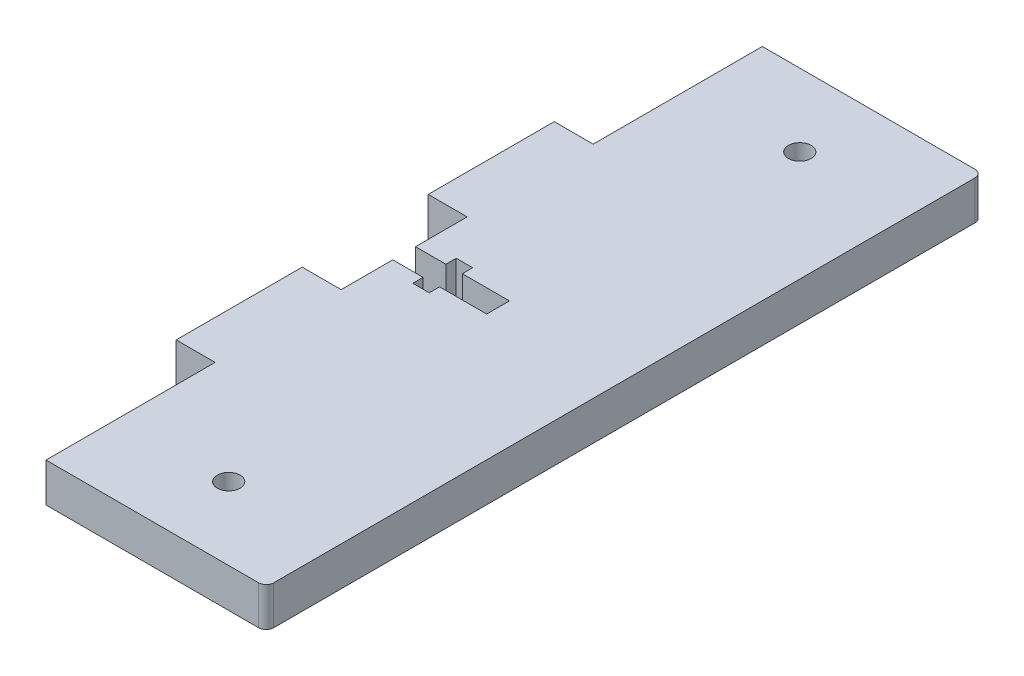
ISO-10303-21;
HEADER;
FILE_DESCRIPTION(('STEP AP214'),'2;1');
FILE_NAME('part.step','',(''),(''),'','','');
FILE_SCHEMA(('AUTOMOTIVE_DESIGN { 1 0 10303 214 1 1 1 1 }'));
ENDSEC;
DATA;
#1=APPLICATION_CONTEXT('core data for automotive mechanical design processes');
#2=APPLICATION_PROTOCOL_DEFINITION('international standard','automotive_design',2000,#1);
#3=PRODUCT_CONTEXT('',#1,'mechanical');
#4=PRODUCT('Part','Part','',(#3));
#5=PRODUCT_RELATED_PRODUCT_CATEGORY('part','',(#4));
#6=PRODUCT_DEFINITION_FORMATION('','',#4);
#7=PRODUCT_DEFINITION_CONTEXT('part definition',#1,'design');
#8=PRODUCT_DEFINITION('design','',#6,#7);
#9=PRODUCT_DEFINITION_SHAPE('','',#8);
#10=(LENGTH_UNIT() NAMED_UNIT(*) SI_UNIT(.MILLI.,.METRE.));
#11=(NAMED_UNIT(*) PLANE_ANGLE_UNIT() SI_UNIT($,.RADIAN.));
#12=(NAMED_UNIT(*) SI_UNIT($,.STERADIAN.) SOLID_ANGLE_UNIT());
#13=UNCERTAINTY_MEASURE_WITH_UNIT(LENGTH_MEASURE(1.E-05),#10,'distance_accuracy_value','');
#14=(GEOMETRIC_REPRESENTATION_CONTEXT(3) GLOBAL_UNCERTAINTY_ASSIGNED_CONTEXT((#13)) GLOBAL_UNIT_ASSIGNED_CONTEXT((#10,
#11,#12)) REPRESENTATION_CONTEXT('',''));
#15=CARTESIAN_POINT('',(0.,0.,0.));
#16=DIRECTION('',(0.,0.,1.));
#17=DIRECTION('',(1.,0.,0.));
#18=AXIS2_PLACEMENT_3D('',#15,#16,#17);
#19=CARTESIAN_POINT('',(12.0090859130973,5.13,-45.0431351735956));
#20=DIRECTION('',(0.,-1.,0.));
#21=DIRECTION('',(0.,0.,-1.));
#22=AXIS2_PLACEMENT_3D('',#19,#20,#21);
#23=CYLINDRICAL_SURFACE('',#22,1.);
#24=CARTESIAN_POINT('',(12.0090859130973,0.,-45.0431351735956));
#25=DIRECTION('',(0.,1.,0.));
#26=DIRECTION('',(0.,0.,1.));
#27=AXIS2_PLACEMENT_3D('',#24,#25,#26);
#28=CIRCLE('',#27,1.);
#29=CARTESIAN_POINT('',(12.0090859130973,0.,-46.0431351735956));
#30=VERTEX_POINT('',#29);
#31=CARTESIAN_POINT('',(13.0090859130973,0.,-45.0431351735956));
#32=VERTEX_POINT('',#31);
#33=EDGE_CURVE('E241',#30,#32,#28,.F.);
#34=ORIENTED_EDGE('',*,*,#33,.F.);
#35=DIRECTION('',(0.,-1.,0.));
#36=VECTOR('',#35,1.);
#37=CARTESIAN_POINT('',(12.0090859130973,5.13,-46.0431351735956));
#38=LINE('',#37,#36);
#39=CARTESIAN_POINT('',(12.0090859130973,5.13,-46.0431351735956));
#40=VERTEX_POINT('',#39);
#41=EDGE_CURVE('E11',#40,#30,#38,.T.);
#42=ORIENTED_EDGE('',*,*,#41,.F.);
#43=CARTESIAN_POINT('',(12.0090859130973,5.13,-45.0431351735956));
#44=DIRECTION('',(0.,1.,0.));
#45=DIRECTION('',(0.,0.,1.));
#46=AXIS2_PLACEMENT_3D('',#43,#44,#45);
#47=CIRCLE('',#46,1.);
#48=CARTESIAN_POINT('',(13.0090859130973,5.13,-45.0431351735956));
#49=VERTEX_POINT('',#48);
#50=EDGE_CURVE('E316',#40,#49,#47,.F.);
#51=ORIENTED_EDGE('',*,*,#50,.T.);
#52=DIRECTION('',(0.,-1.,0.));
#53=VECTOR('',#52,1.);
#54=CARTESIAN_POINT('',(13.0090859130973,5.13,-45.0431351735956));
#55=LINE('',#54,#53);
#56=EDGE_CURVE('E137',#49,#32,#55,.T.);
#57=ORIENTED_EDGE('',*,*,#56,.T.);
#58=EDGE_LOOP('',(#34,#42,#51,#57));
#59=FACE_BOUND('',#58,.T.);
#60=ADVANCED_FACE('F33',(#59),#23,.T.);
#61=CARTESIAN_POINT('',(-82.2456745189973,5.13,-46.0431351735956));
#62=DIRECTION('',(0.,0.,-1.));
#63=DIRECTION('',(-1.,0.,0.));
#64=AXIS2_PLACEMENT_3D('',#61,#62,#63);
#65=PLANE('',#64);
#66=DIRECTION('',(1.,0.,0.));
#67=VECTOR('',#66,1.);
#68=CARTESIAN_POINT('',(-82.2456745189973,0.,-46.0431351735956));
#69=LINE('',#68,#67);
#70=CARTESIAN_POINT('',(-15.9909140869027,0.,-46.0431351735956));
#71=VERTEX_POINT('',#70);
#72=EDGE_CURVE('E244',#71,#30,#69,.T.);
#73=ORIENTED_EDGE('',*,*,#72,.F.);
#74=DIRECTION('',(0.,-1.,0.));
#75=VECTOR('',#74,1.);
#76=CARTESIAN_POINT('',(-15.9909140869027,5.13,-46.0431351735956));
#77=LINE('',#76,#75);
#78=CARTESIAN_POINT('',(-15.9909140869027,5.13,-46.0431351735956));
#79=VERTEX_POINT('',#78);
#80=EDGE_CURVE('E41',#79,#71,#77,.T.);
#81=ORIENTED_EDGE('',*,*,#80,.F.);
#82=DIRECTION('',(1.,0.,0.));
#83=VECTOR('',#82,1.);
#84=CARTESIAN_POINT('',(-82.2456745189973,5.13,-46.0431351735956));
#85=LINE('',#84,#83);
#86=EDGE_CURVE('E386',#79,#40,#85,.T.);
#87=ORIENTED_EDGE('',*,*,#86,.T.);
#88=ORIENTED_EDGE('',*,*,#41,.T.);
#89=EDGE_LOOP('',(#73,#81,#87,#88));
#90=FACE_BOUND('',#89,.T.);
#91=ADVANCED_FACE('F373',(#90),#65,.T.);
#92=CARTESIAN_POINT('',(-15.9909140869027,5.13,1.13686482640438));
#93=DIRECTION('',(-1.,0.,0.));
#94=DIRECTION('',(0.,0.,1.));
#95=AXIS2_PLACEMENT_3D('',#92,#93,#94);
#96=PLANE('',#95);
#97=DIRECTION('',(0.,0.,-1.));
#98=VECTOR('',#97,1.);
#99=CARTESIAN_POINT('',(-15.9909140869027,0.,1.13686482640438));
#100=LINE('',#99,#98);
#101=CARTESIAN_POINT('',(-15.9909140869027,0.,-23.7631351735957));
#102=VERTEX_POINT('',#101);
#103=EDGE_CURVE('E247',#102,#71,#100,.T.);
#104=ORIENTED_EDGE('',*,*,#103,.F.);
#105=DIRECTION('',(0.,-1.,0.));
#106=VECTOR('',#105,1.);
#107=CARTESIAN_POINT('',(-15.9909140869027,5.13,-23.7631351735957));
#108=LINE('',#107,#106);
#109=CARTESIAN_POINT('',(-15.9909140869027,5.13,-23.7631351735957));
#110=VERTEX_POINT('',#109);
#111=EDGE_CURVE('E362',#110,#102,#108,.T.);
#112=ORIENTED_EDGE('',*,*,#111,.F.);
#113=DIRECTION('',(0.,0.,-1.));
#114=VECTOR('',#113,1.);
#115=CARTESIAN_POINT('',(-15.9909140869027,5.13,1.13686482640438));
#116=LINE('',#115,#114);
#117=EDGE_CURVE('E369',#110,#79,#116,.T.);
#118=ORIENTED_EDGE('',*,*,#117,.T.);
#119=ORIENTED_EDGE('',*,*,#80,.T.);
#120=EDGE_LOOP('',(#104,#112,#118,#119));
#121=FACE_BOUND('',#120,.T.);
#122=ADVANCED_FACE('F367',(#121),#96,.T.);
#123=CARTESIAN_POINT('',(-82.2456745189973,5.13,-23.7631351735957));
#124=DIRECTION('',(0.,0.,-1.));
#125=DIRECTION('',(-1.,0.,0.));
#126=AXIS2_PLACEMENT_3D('',#123,#124,#125);
#127=PLANE('',#126);
#128=DIRECTION('',(1.,0.,0.));
#129=VECTOR('',#128,1.);
#130=CARTESIAN_POINT('',(-82.2456745189973,0.,-23.7631351735957));
#131=LINE('',#130,#129);
#132=CARTESIAN_POINT('',(-21.1209140869026,0.,-23.7631351735957));
#133=VERTEX_POINT('',#132);
#134=EDGE_CURVE('E250',#133,#102,#131,.T.);
#135=ORIENTED_EDGE('',*,*,#134,.F.);
#136=DIRECTION('',(0.,-1.,0.));
#137=VECTOR('',#136,1.);
#138=CARTESIAN_POINT('',(-21.1209140869026,5.13,-23.7631351735957));
#139=LINE('',#138,#137);
#140=CARTESIAN_POINT('',(-21.1209140869026,5.13,-23.7631351735957));
#141=VERTEX_POINT('',#140);
#142=EDGE_CURVE('E360',#141,#133,#139,.T.);
#143=ORIENTED_EDGE('',*,*,#142,.F.);
#144=DIRECTION('',(1.,0.,0.));
#145=VECTOR('',#144,1.);
#146=CARTESIAN_POINT('',(-82.2456745189973,5.13,-23.7631351735957));
#147=LINE('',#146,#145);
#148=EDGE_CURVE('E383',#141,#110,#147,.T.);
#149=ORIENTED_EDGE('',*,*,#148,.T.);
#150=ORIENTED_EDGE('',*,*,#111,.T.);
#151=EDGE_LOOP('',(#135,#143,#149,#150));
#152=FACE_BOUND('',#151,.T.);
#153=ADVANCED_FACE('F380',(#152),#127,.T.);
#154=CARTESIAN_POINT('',(-21.1209140869026,5.13,1.13686482640437));
#155=DIRECTION('',(-1.,0.,0.));
#156=DIRECTION('',(0.,0.,1.));
#157=AXIS2_PLACEMENT_3D('',#154,#155,#156);
#158=PLANE('',#157);
#159=DIRECTION('',(0.,0.,-1.));
#160=VECTOR('',#159,1.);
#161=CARTESIAN_POINT('',(-21.1209140869026,0.,1.13686482640437));
#162=LINE('',#161,#160);
#163=CARTESIAN_POINT('',(-21.1209140869026,0.,-7.16313517359567));
#164=VERTEX_POINT('',#163);
#165=EDGE_CURVE('E253',#164,#133,#162,.T.);
#166=ORIENTED_EDGE('',*,*,#165,.F.);
#167=DIRECTION('',(0.,-1.,0.));
#168=VECTOR('',#167,1.);
#169=CARTESIAN_POINT('',(-21.1209140869026,5.13,-7.16313517359567));
#170=LINE('',#169,#168);
#171=CARTESIAN_POINT('',(-21.1209140869026,5.13,-7.16313517359567));
#172=VERTEX_POINT('',#171);
#173=EDGE_CURVE('E358',#172,#164,#170,.T.);
#174=ORIENTED_EDGE('',*,*,#173,.F.);
#175=DIRECTION('',(0.,0.,-1.));
#176=VECTOR('',#175,1.);
#177=CARTESIAN_POINT('',(-21.1209140869026,5.13,1.13686482640437));
#178=LINE('',#177,#176);
#179=EDGE_CURVE('E388',#172,#141,#178,.T.);
#180=ORIENTED_EDGE('',*,*,#179,.T.);
#181=ORIENTED_EDGE('',*,*,#142,.T.);
#182=EDGE_LOOP('',(#166,#174,#180,#181));
#183=FACE_BOUND('',#182,.T.);
#184=ADVANCED_FACE('F462',(#183),#158,.T.);
#185=CARTESIAN_POINT('',(-82.2456745189973,5.13,-7.16313517359566));
#186=DIRECTION('',(0.,0.,1.));
#187=DIRECTION('',(1.,0.,0.));
#188=AXIS2_PLACEMENT_3D('',#185,#186,#187);
#189=PLANE('',#188);
#190=DIRECTION('',(-1.,0.,0.));
#191=VECTOR('',#190,1.);
#192=CARTESIAN_POINT('',(-82.2456745189973,0.,-7.16313517359566));
#193=LINE('',#192,#191);
#194=CARTESIAN_POINT('',(-15.9909140869026,0.,-7.16313517359567));
#195=VERTEX_POINT('',#194);
#196=EDGE_CURVE('E256',#195,#164,#193,.T.);
#197=ORIENTED_EDGE('',*,*,#196,.F.);
#198=DIRECTION('',(0.,-1.,0.));
#199=VECTOR('',#198,1.);
#200=CARTESIAN_POINT('',(-15.9909140869026,5.13,-7.16313517359567));
#201=LINE('',#200,#199);
#202=CARTESIAN_POINT('',(-15.9909140869026,5.13,-7.16313517359567));
#203=VERTEX_POINT('',#202);
#204=EDGE_CURVE('E356',#203,#195,#201,.T.);
#205=ORIENTED_EDGE('',*,*,#204,.F.);
#206=DIRECTION('',(-1.,0.,0.));
#207=VECTOR('',#206,1.);
#208=CARTESIAN_POINT('',(-82.2456745189973,5.13,-7.16313517359566));
#209=LINE('',#208,#207);
#210=EDGE_CURVE('E394',#203,#172,#209,.T.);
#211=ORIENTED_EDGE('',*,*,#210,.T.);
#212=ORIENTED_EDGE('',*,*,#173,.T.);
#213=EDGE_LOOP('',(#197,#205,#211,#212));
#214=FACE_BOUND('',#213,.T.);
#215=ADVANCED_FACE('F465',(#214),#189,.T.);
#216=CARTESIAN_POINT('',(-15.9909140869026,5.13,1.13686482640438));
#217=DIRECTION('',(-1.,0.,0.));
#218=DIRECTION('',(0.,0.,1.));
#219=AXIS2_PLACEMENT_3D('',#216,#217,#218);
#220=PLANE('',#219);
#221=DIRECTION('',(0.,0.,-1.));
#222=VECTOR('',#221,1.);
#223=CARTESIAN_POINT('',(-15.9909140869026,0.,1.13686482640438));
#224=LINE('',#223,#222);
#225=CARTESIAN_POINT('',(-15.9909140869026,0.,-0.361635173595668));
#226=VERTEX_POINT('',#225);
#227=EDGE_CURVE('E259',#226,#195,#224,.T.);
#228=ORIENTED_EDGE('',*,*,#227,.F.);
#229=DIRECTION('',(0.,-1.,0.));
#230=VECTOR('',#229,1.);
#231=CARTESIAN_POINT('',(-15.9909140869026,5.13,-0.361635173595668));
#232=LINE('',#231,#230);
#233=CARTESIAN_POINT('',(-15.9909140869026,5.13,-0.361635173595668));
#234=VERTEX_POINT('',#233);
#235=EDGE_CURVE('E354',#234,#226,#232,.T.);
#236=ORIENTED_EDGE('',*,*,#235,.F.);
#237=DIRECTION('',(0.,0.,-1.));
#238=VECTOR('',#237,1.);
#239=CARTESIAN_POINT('',(-15.9909140869026,5.13,1.13686482640438));
#240=LINE('',#239,#238);
#241=EDGE_CURVE('E397',#234,#203,#240,.T.);
#242=ORIENTED_EDGE('',*,*,#241,.T.);
#243=ORIENTED_EDGE('',*,*,#204,.T.);
#244=EDGE_LOOP('',(#228,#236,#242,#243));
#245=FACE_BOUND('',#244,.T.);
#246=ADVANCED_FACE('F469',(#245),#220,.T.);
#247=CARTESIAN_POINT('',(-82.2456745189973,5.13,-0.361635173595757));
#248=DIRECTION('',(0.,0.,1.));
#249=DIRECTION('',(1.,0.,0.));
#250=AXIS2_PLACEMENT_3D('',#247,#248,#249);
#251=PLANE('',#250);
#252=DIRECTION('',(-1.,0.,0.));
#253=VECTOR('',#252,1.);
#254=CARTESIAN_POINT('',(-82.2456745189973,0.,-0.361635173595757));
#255=LINE('',#254,#253);
#256=CARTESIAN_POINT('',(-11.9959140869028,0.,-0.361635173595662));
#257=VERTEX_POINT('',#256);
#258=EDGE_CURVE('E262',#257,#226,#255,.T.);
#259=ORIENTED_EDGE('',*,*,#258,.F.);
#260=DIRECTION('',(0.,-1.,0.));
#261=VECTOR('',#260,1.);
#262=CARTESIAN_POINT('',(-11.9959140869028,5.13,-0.361635173595662));
#263=LINE('',#262,#261);
#264=CARTESIAN_POINT('',(-11.9959140869028,5.13,-0.361635173595662));
#265=VERTEX_POINT('',#264);
#266=EDGE_CURVE('E352',#265,#257,#263,.T.);
#267=ORIENTED_EDGE('',*,*,#266,.F.);
#268=DIRECTION('',(-1.,0.,0.));
#269=VECTOR('',#268,1.);
#270=CARTESIAN_POINT('',(-82.2456745189973,5.13,-0.361635173595757));
#271=LINE('',#270,#269);
#272=EDGE_CURVE('E400',#265,#234,#271,.T.);
#273=ORIENTED_EDGE('',*,*,#272,.T.);
#274=ORIENTED_EDGE('',*,*,#235,.T.);
#275=EDGE_LOOP('',(#259,#267,#273,#274));
#276=FACE_BOUND('',#275,.T.);
#277=ADVANCED_FACE('F473',(#276),#251,.T.);
#278=CARTESIAN_POINT('',(-11.9959140869028,5.13,1.13686482640456));
#279=DIRECTION('',(1.,0.,0.));
#280=DIRECTION('',(0.,0.,-1.));
#281=AXIS2_PLACEMENT_3D('',#278,#279,#280);
#282=PLANE('',#281);
#283=DIRECTION('',(0.,0.,1.));
#284=VECTOR('',#283,1.);
#285=CARTESIAN_POINT('',(-11.9959140869028,0.,1.13686482640456));
#286=LINE('',#285,#284);
#287=CARTESIAN_POINT('',(-11.9959140869028,0.,-1.72063517359567));
#288=VERTEX_POINT('',#287);
#289=EDGE_CURVE('E265',#288,#257,#286,.T.);
#290=ORIENTED_EDGE('',*,*,#289,.F.);
#291=DIRECTION('',(0.,-1.,0.));
#292=VECTOR('',#291,1.);
#293=CARTESIAN_POINT('',(-11.9959140869028,5.13,-1.72063517359567));
#294=LINE('',#293,#292);
#295=CARTESIAN_POINT('',(-11.9959140869028,5.13,-1.72063517359567));
#296=VERTEX_POINT('',#295);
#297=EDGE_CURVE('E350',#296,#288,#294,.T.);
#298=ORIENTED_EDGE('',*,*,#297,.F.);
#299=DIRECTION('',(0.,0.,1.));
#300=VECTOR('',#299,1.);
#301=CARTESIAN_POINT('',(-11.9959140869028,5.13,1.13686482640456));
#302=LINE('',#301,#300);
#303=EDGE_CURVE('E403',#296,#265,#302,.T.);
#304=ORIENTED_EDGE('',*,*,#303,.T.);
#305=ORIENTED_EDGE('',*,*,#266,.T.);
#306=EDGE_LOOP('',(#290,#298,#304,#305));
#307=FACE_BOUND('',#306,.T.);
#308=ADVANCED_FACE('F477',(#307),#282,.T.);
#309=CARTESIAN_POINT('',(-82.2456745189972,5.13,-1.72063517360027));
#310=DIRECTION('',(0.,0.,1.));
#311=DIRECTION('',(1.,0.,0.));
#312=AXIS2_PLACEMENT_3D('',#309,#310,#311);
#313=PLANE('',#312);
#314=DIRECTION('',(-1.,0.,0.));
#315=VECTOR('',#314,1.);
#316=CARTESIAN_POINT('',(-82.2456745189972,0.,-1.72063517360027));
#317=LINE('',#316,#315);
#318=CARTESIAN_POINT('',(-9.82891408690274,0.,-1.72063517359553));
#319=VERTEX_POINT('',#318);
#320=EDGE_CURVE('E268',#319,#288,#317,.T.);
#321=ORIENTED_EDGE('',*,*,#320,.F.);
#322=DIRECTION('',(0.,-1.,0.));
#323=VECTOR('',#322,1.);
#324=CARTESIAN_POINT('',(-9.82891408690274,5.13,-1.72063517359553));
#325=LINE('',#324,#323);
#326=CARTESIAN_POINT('',(-9.82891408690274,5.13,-1.72063517359553));
#327=VERTEX_POINT('',#326);
#328=EDGE_CURVE('E348',#327,#319,#325,.T.);
#329=ORIENTED_EDGE('',*,*,#328,.F.);
#330=DIRECTION('',(-1.,0.,0.));
#331=VECTOR('',#330,1.);
#332=CARTESIAN_POINT('',(-82.2456745189972,5.13,-1.72063517360027));
#333=LINE('',#332,#331);
#334=EDGE_CURVE('E406',#327,#296,#333,.T.);
#335=ORIENTED_EDGE('',*,*,#334,.T.);
#336=ORIENTED_EDGE('',*,*,#297,.T.);
#337=EDGE_LOOP('',(#321,#329,#335,#336));
#338=FACE_BOUND('',#337,.T.);
#339=ADVANCED_FACE('F481',(#338),#313,.T.);
#340=CARTESIAN_POINT('',(-9.82891408690274,5.13,1.13686482640456));
#341=DIRECTION('',(-1.,0.,0.));
#342=DIRECTION('',(0.,0.,1.));
#343=AXIS2_PLACEMENT_3D('',#340,#341,#342);
#344=PLANE('',#343);
#345=DIRECTION('',(0.,0.,-1.));
#346=VECTOR('',#345,1.);
#347=CARTESIAN_POINT('',(-9.82891408690274,0.,1.13686482640456));
#348=LINE('',#347,#346);
#349=CARTESIAN_POINT('',(-9.82891408690274,0.,-0.361635173595597));
#350=VERTEX_POINT('',#349);
#351=EDGE_CURVE('E271',#350,#319,#348,.T.);
#352=ORIENTED_EDGE('',*,*,#351,.F.);
#353=DIRECTION('',(0.,-1.,0.));
#354=VECTOR('',#353,1.);
#355=CARTESIAN_POINT('',(-9.82891408690274,5.13,-0.361635173595597));
#356=LINE('',#355,#354);
#357=CARTESIAN_POINT('',(-9.82891408690274,5.13,-0.361635173595597));
#358=VERTEX_POINT('',#357);
#359=EDGE_CURVE('E346',#358,#350,#356,.T.);
#360=ORIENTED_EDGE('',*,*,#359,.F.);
#361=DIRECTION('',(0.,0.,-1.));
#362=VECTOR('',#361,1.);
#363=CARTESIAN_POINT('',(-9.82891408690274,5.13,1.13686482640456));
#364=LINE('',#363,#362);
#365=EDGE_CURVE('E409',#358,#327,#364,.T.);
#366=ORIENTED_EDGE('',*,*,#365,.T.);
#367=ORIENTED_EDGE('',*,*,#328,.T.);
#368=EDGE_LOOP('',(#352,#360,#366,#367));
#369=FACE_BOUND('',#368,.T.);
#370=ADVANCED_FACE('F485',(#369),#344,.T.);
#371=CARTESIAN_POINT('',(-82.2456745189973,5.13,-0.3616351735994));
#372=DIRECTION('',(0.,0.,1.));
#373=DIRECTION('',(1.,0.,0.));
#374=AXIS2_PLACEMENT_3D('',#371,#372,#373);
#375=PLANE('',#374);
#376=DIRECTION('',(-1.,0.,0.));
#377=VECTOR('',#376,1.);
#378=CARTESIAN_POINT('',(-82.2456745189973,0.,-0.3616351735994));
#379=LINE('',#378,#377);
#380=CARTESIAN_POINT('',(-3.62191408690178,0.,-0.361635173595271));
#381=VERTEX_POINT('',#380);
#382=EDGE_CURVE('E274',#381,#350,#379,.T.);
#383=ORIENTED_EDGE('',*,*,#382,.F.);
#384=DIRECTION('',(0.,-1.,0.));
#385=VECTOR('',#384,1.);
#386=CARTESIAN_POINT('',(-3.62191408690178,5.13,-0.361635173595271));
#387=LINE('',#386,#385);
#388=CARTESIAN_POINT('',(-3.62191408690178,5.13,-0.361635173595271));
#389=VERTEX_POINT('',#388);
#390=EDGE_CURVE('E344',#389,#381,#387,.T.);
#391=ORIENTED_EDGE('',*,*,#390,.F.);
#392=DIRECTION('',(-1.,0.,0.));
#393=VECTOR('',#392,1.);
#394=CARTESIAN_POINT('',(-82.2456745189973,5.13,-0.3616351735994));
#395=LINE('',#394,#393);
#396=EDGE_CURVE('E412',#389,#358,#395,.T.);
#397=ORIENTED_EDGE('',*,*,#396,.T.);
#398=ORIENTED_EDGE('',*,*,#359,.T.);
#399=EDGE_LOOP('',(#383,#391,#397,#398));
#400=FACE_BOUND('',#399,.T.);
#401=ADVANCED_FACE('F489',(#400),#375,.T.);
#402=CARTESIAN_POINT('',(-3.62191408690181,5.13,1.13686482640593));
#403=DIRECTION('',(-1.,0.,0.));
#404=DIRECTION('',(0.,0.,1.));
#405=AXIS2_PLACEMENT_3D('',#402,#403,#404);
#406=PLANE('',#405);
#407=DIRECTION('',(0.,0.,-1.));
#408=VECTOR('',#407,1.);
#409=CARTESIAN_POINT('',(-3.62191408690181,0.,1.13686482640593));
#410=LINE('',#409,#408);
#411=CARTESIAN_POINT('',(-3.62191408690184,0.,2.63536482640482));
#412=VERTEX_POINT('',#411);
#413=EDGE_CURVE('E277',#412,#381,#410,.T.);
#414=ORIENTED_EDGE('',*,*,#413,.F.);
#415=DIRECTION('',(0.,-1.,0.));
#416=VECTOR('',#415,1.);
#417=CARTESIAN_POINT('',(-3.62191408690184,5.13,2.63536482640482));
#418=LINE('',#417,#416);
#419=CARTESIAN_POINT('',(-3.62191408690184,5.13,2.63536482640482));
#420=VERTEX_POINT('',#419);
#421=EDGE_CURVE('E342',#420,#412,#418,.T.);
#422=ORIENTED_EDGE('',*,*,#421,.F.);
#423=DIRECTION('',(0.,0.,-1.));
#424=VECTOR('',#423,1.);
#425=CARTESIAN_POINT('',(-3.62191408690181,5.13,1.13686482640593));
#426=LINE('',#425,#424);
#427=EDGE_CURVE('E415',#420,#389,#426,.T.);
#428=ORIENTED_EDGE('',*,*,#427,.T.);
#429=ORIENTED_EDGE('',*,*,#390,.T.);
#430=EDGE_LOOP('',(#414,#422,#428,#429));
#431=FACE_BOUND('',#430,.T.);
#432=ADVANCED_FACE('F493',(#431),#406,.T.);
#433=CARTESIAN_POINT('',(-82.2456745189974,5.13,2.63536482640025));
#434=DIRECTION('',(0.,0.,-1.));
#435=DIRECTION('',(-1.,0.,0.));
#436=AXIS2_PLACEMENT_3D('',#433,#434,#435);
#437=PLANE('',#436);
#438=DIRECTION('',(1.,0.,0.));
#439=VECTOR('',#438,1.);
#440=CARTESIAN_POINT('',(-82.2456745189974,0.,2.63536482640025));
#441=LINE('',#440,#439);
#442=CARTESIAN_POINT('',(-9.82891408690178,0.,2.63536482640446));
#443=VERTEX_POINT('',#442);
#444=EDGE_CURVE('E280',#443,#412,#441,.T.);
#445=ORIENTED_EDGE('',*,*,#444,.F.);
#446=DIRECTION('',(0.,-1.,0.));
#447=VECTOR('',#446,1.);
#448=CARTESIAN_POINT('',(-9.82891408690178,5.13,2.63536482640446));
#449=LINE('',#448,#447);
#450=CARTESIAN_POINT('',(-9.82891408690178,5.13,2.63536482640446));
#451=VERTEX_POINT('',#450);
#452=EDGE_CURVE('E340',#451,#443,#449,.T.);
#453=ORIENTED_EDGE('',*,*,#452,.F.);
#454=DIRECTION('',(1.,0.,0.));
#455=VECTOR('',#454,1.);
#456=CARTESIAN_POINT('',(-82.2456745189974,5.13,2.63536482640025));
#457=LINE('',#456,#455);
#458=EDGE_CURVE('E418',#451,#420,#457,.T.);
#459=ORIENTED_EDGE('',*,*,#458,.T.);
#460=ORIENTED_EDGE('',*,*,#421,.T.);
#461=EDGE_LOOP('',(#445,#453,#459,#460));
#462=FACE_BOUND('',#461,.T.);
#463=ADVANCED_FACE('F497',(#462),#437,.T.);
#464=CARTESIAN_POINT('',(-9.82891408690177,5.13,1.13686482640456));
#465=DIRECTION('',(-1.,0.,0.));
#466=DIRECTION('',(0.,0.,1.));
#467=AXIS2_PLACEMENT_3D('',#464,#465,#466);
#468=PLANE('',#467);
#469=DIRECTION('',(0.,0.,-1.));
#470=VECTOR('',#469,1.);
#471=CARTESIAN_POINT('',(-9.82891408690177,0.,1.13686482640456));
#472=LINE('',#471,#470);
#473=CARTESIAN_POINT('',(-9.82891408690178,0.,3.99436482640448));
#474=VERTEX_POINT('',#473);
#475=EDGE_CURVE('E283',#474,#443,#472,.T.);
#476=ORIENTED_EDGE('',*,*,#475,.F.);
#477=DIRECTION('',(0.,-1.,0.));
#478=VECTOR('',#477,1.);
#479=CARTESIAN_POINT('',(-9.82891408690178,5.13,3.99436482640448));
#480=LINE('',#479,#478);
#481=CARTESIAN_POINT('',(-9.82891408690178,5.13,3.99436482640448));
#482=VERTEX_POINT('',#481);
#483=EDGE_CURVE('E338',#482,#474,#480,.T.);
#484=ORIENTED_EDGE('',*,*,#483,.F.);
#485=DIRECTION('',(0.,0.,-1.));
#486=VECTOR('',#485,1.);
#487=CARTESIAN_POINT('',(-9.82891408690177,5.13,1.13686482640456));
#488=LINE('',#487,#486);
#489=EDGE_CURVE('E421',#482,#451,#488,.T.);
#490=ORIENTED_EDGE('',*,*,#489,.T.);
#491=ORIENTED_EDGE('',*,*,#452,.T.);
#492=EDGE_LOOP('',(#476,#484,#490,#491));
#493=FACE_BOUND('',#492,.T.);
#494=ADVANCED_FACE('F501',(#493),#468,.T.);
#495=CARTESIAN_POINT('',(-82.2456745189975,5.13,3.9943648263997));
#496=DIRECTION('',(0.,0.,-1.));
#497=DIRECTION('',(-1.,0.,0.));
#498=AXIS2_PLACEMENT_3D('',#495,#496,#497);
#499=PLANE('',#498);
#500=DIRECTION('',(1.,0.,0.));
#501=VECTOR('',#500,1.);
#502=CARTESIAN_POINT('',(-82.2456745189975,0.,3.9943648263997));
#503=LINE('',#502,#501);
#504=CARTESIAN_POINT('',(-11.9959140869018,0.,3.99436482640434));
#505=VERTEX_POINT('',#504);
#506=EDGE_CURVE('E286',#505,#474,#503,.T.);
#507=ORIENTED_EDGE('',*,*,#506,.F.);
#508=DIRECTION('',(0.,-1.,0.));
#509=VECTOR('',#508,1.);
#510=CARTESIAN_POINT('',(-11.9959140869018,5.13,3.99436482640434));
#511=LINE('',#510,#509);
#512=CARTESIAN_POINT('',(-11.9959140869018,5.13,3.99436482640434));
#513=VERTEX_POINT('',#512);
#514=EDGE_CURVE('E336',#513,#505,#511,.T.);
#515=ORIENTED_EDGE('',*,*,#514,.F.);
#516=DIRECTION('',(1.,0.,0.));
#517=VECTOR('',#516,1.);
#518=CARTESIAN_POINT('',(-82.2456745189975,5.13,3.9943648263997));
#519=LINE('',#518,#517);
#520=EDGE_CURVE('E424',#513,#482,#519,.T.);
#521=ORIENTED_EDGE('',*,*,#520,.T.);
#522=ORIENTED_EDGE('',*,*,#483,.T.);
#523=EDGE_LOOP('',(#507,#515,#521,#522));
#524=FACE_BOUND('',#523,.T.);
#525=ADVANCED_FACE('F505',(#524),#499,.T.);
#526=CARTESIAN_POINT('',(-11.9959140869018,5.13,1.13686482640456));
#527=DIRECTION('',(1.,0.,0.));
#528=DIRECTION('',(0.,0.,-1.));
#529=AXIS2_PLACEMENT_3D('',#526,#527,#528);
#530=PLANE('',#529);
#531=DIRECTION('',(0.,0.,1.));
#532=VECTOR('',#531,1.);
#533=CARTESIAN_POINT('',(-11.9959140869018,0.,1.13686482640456));
#534=LINE('',#533,#532);
#535=CARTESIAN_POINT('',(-11.9959140869018,0.,2.63536482640438));
#536=VERTEX_POINT('',#535);
#537=EDGE_CURVE('E289',#536,#505,#534,.T.);
#538=ORIENTED_EDGE('',*,*,#537,.F.);
#539=DIRECTION('',(0.,-1.,0.));
#540=VECTOR('',#539,1.);
#541=CARTESIAN_POINT('',(-11.9959140869018,5.13,2.63536482640438));
#542=LINE('',#541,#540);
#543=CARTESIAN_POINT('',(-11.9959140869018,5.13,2.63536482640438));
#544=VERTEX_POINT('',#543);
#545=EDGE_CURVE('E334',#544,#536,#542,.T.);
#546=ORIENTED_EDGE('',*,*,#545,.F.);
#547=DIRECTION('',(0.,0.,1.));
#548=VECTOR('',#547,1.);
#549=CARTESIAN_POINT('',(-11.9959140869018,5.13,1.13686482640456));
#550=LINE('',#549,#548);
#551=EDGE_CURVE('E427',#544,#513,#550,.T.);
#552=ORIENTED_EDGE('',*,*,#551,.T.);
#553=ORIENTED_EDGE('',*,*,#514,.T.);
#554=EDGE_LOOP('',(#538,#546,#552,#553));
#555=FACE_BOUND('',#554,.T.);
#556=ADVANCED_FACE('F509',(#555),#530,.T.);
#557=CARTESIAN_POINT('',(-82.2456745189973,5.13,2.63536482640428));
#558=DIRECTION('',(0.,0.,-1.));
#559=DIRECTION('',(-1.,0.,0.));
#560=AXIS2_PLACEMENT_3D('',#557,#558,#559);
#561=PLANE('',#560);
#562=DIRECTION('',(1.,0.,0.));
#563=VECTOR('',#562,1.);
#564=CARTESIAN_POINT('',(-82.2456745189973,0.,2.63536482640428));
#565=LINE('',#564,#563);
#566=CARTESIAN_POINT('',(-15.9909140869027,0.,2.63536482640437));
#567=VERTEX_POINT('',#566);
#568=EDGE_CURVE('E292',#567,#536,#565,.T.);
#569=ORIENTED_EDGE('',*,*,#568,.F.);
#570=DIRECTION('',(0.,-1.,0.));
#571=VECTOR('',#570,1.);
#572=CARTESIAN_POINT('',(-15.9909140869027,5.13,2.63536482640437));
#573=LINE('',#572,#571);
#574=CARTESIAN_POINT('',(-15.9909140869027,5.13,2.63536482640437));
#575=VERTEX_POINT('',#574);
#576=EDGE_CURVE('E332',#575,#567,#573,.T.);
#577=ORIENTED_EDGE('',*,*,#576,.F.);
#578=DIRECTION('',(1.,0.,0.));
#579=VECTOR('',#578,1.);
#580=CARTESIAN_POINT('',(-82.2456745189973,5.13,2.63536482640428));
#581=LINE('',#580,#579);
#582=EDGE_CURVE('E430',#575,#544,#581,.T.);
#583=ORIENTED_EDGE('',*,*,#582,.T.);
#584=ORIENTED_EDGE('',*,*,#545,.T.);
#585=EDGE_LOOP('',(#569,#577,#583,#584));
#586=FACE_BOUND('',#585,.T.);
#587=ADVANCED_FACE('F513',(#586),#561,.T.);
#588=CARTESIAN_POINT('',(-15.9909140869027,5.13,1.13686482640438));
#589=DIRECTION('',(1.,0.,0.));
#590=DIRECTION('',(0.,0.,-1.));
#591=AXIS2_PLACEMENT_3D('',#588,#589,#590);
#592=PLANE('',#591);
#593=DIRECTION('',(0.,0.,1.));
#594=VECTOR('',#593,1.);
#595=CARTESIAN_POINT('',(-15.9909140869027,0.,1.13686482640438));
#596=LINE('',#595,#594);
#597=CARTESIAN_POINT('',(-15.9909140869027,0.,9.43686482640437));
#598=VERTEX_POINT('',#597);
#599=EDGE_CURVE('E295',#567,#598,#596,.T.);
#600=ORIENTED_EDGE('',*,*,#599,.T.);
#601=DIRECTION('',(0.,-1.,0.));
#602=VECTOR('',#601,1.);
#603=CARTESIAN_POINT('',(-15.9909140869027,5.13,9.43686482640437));
#604=LINE('',#603,#602);
#605=CARTESIAN_POINT('',(-15.9909140869027,5.13,9.43686482640437));
#606=VERTEX_POINT('',#605);
#607=EDGE_CURVE('E329',#606,#598,#604,.T.);
#608=ORIENTED_EDGE('',*,*,#607,.F.);
#609=DIRECTION('',(0.,0.,1.));
#610=VECTOR('',#609,1.);
#611=CARTESIAN_POINT('',(-15.9909140869027,5.13,1.13686482640438));
#612=LINE('',#611,#610);
#613=EDGE_CURVE('E433',#575,#606,#612,.T.);
#614=ORIENTED_EDGE('',*,*,#613,.F.);
#615=ORIENTED_EDGE('',*,*,#576,.T.);
#616=EDGE_LOOP('',(#600,#608,#614,#615));
#617=FACE_BOUND('',#616,.T.);
#618=ADVANCED_FACE('F517',(#617),#592,.F.);
#619=CARTESIAN_POINT('',(-82.2456745189973,5.13,9.4368648264044));
#620=DIRECTION('',(0.,0.,1.));
#621=DIRECTION('',(1.,0.,0.));
#622=AXIS2_PLACEMENT_3D('',#619,#620,#621);
#623=PLANE('',#622);
#624=DIRECTION('',(-1.,0.,0.));
#625=VECTOR('',#624,1.);
#626=CARTESIAN_POINT('',(-82.2456745189973,0.,9.4368648264044));
#627=LINE('',#626,#625);
#628=CARTESIAN_POINT('',(-21.1209140869027,0.,9.43686482640438));
#629=VERTEX_POINT('',#628);
#630=EDGE_CURVE('E297',#598,#629,#627,.T.);
#631=ORIENTED_EDGE('',*,*,#630,.T.);
#632=DIRECTION('',(0.,-1.,0.));
#633=VECTOR('',#632,1.);
#634=CARTESIAN_POINT('',(-21.1209140869027,5.13,9.43686482640438));
#635=LINE('',#634,#633);
#636=CARTESIAN_POINT('',(-21.1209140869027,5.13,9.43686482640438));
#637=VERTEX_POINT('',#636);
#638=EDGE_CURVE('E326',#637,#629,#635,.T.);
#639=ORIENTED_EDGE('',*,*,#638,.F.);
#640=DIRECTION('',(-1.,0.,0.));
#641=VECTOR('',#640,1.);
#642=CARTESIAN_POINT('',(-82.2456745189973,5.13,9.4368648264044));
#643=LINE('',#642,#641);
#644=EDGE_CURVE('E435',#606,#637,#643,.T.);
#645=ORIENTED_EDGE('',*,*,#644,.F.);
#646=ORIENTED_EDGE('',*,*,#607,.T.);
#647=EDGE_LOOP('',(#631,#639,#645,#646));
#648=FACE_BOUND('',#647,.T.);
#649=ADVANCED_FACE('F521',(#648),#623,.F.);
#650=CARTESIAN_POINT('',(-21.1209140869027,5.13,1.13686482640437));
#651=DIRECTION('',(1.,0.,0.));
#652=DIRECTION('',(0.,0.,-1.));
#653=AXIS2_PLACEMENT_3D('',#650,#651,#652);
#654=PLANE('',#653);
#655=DIRECTION('',(0.,0.,1.));
#656=VECTOR('',#655,1.);
#657=CARTESIAN_POINT('',(-21.1209140869027,0.,1.13686482640437));
#658=LINE('',#657,#656);
#659=CARTESIAN_POINT('',(-21.1209140869027,0.,26.0368648264044));
#660=VERTEX_POINT('',#659);
#661=EDGE_CURVE('E299',#629,#660,#658,.T.);
#662=ORIENTED_EDGE('',*,*,#661,.T.);
#663=DIRECTION('',(0.,-1.,0.));
#664=VECTOR('',#663,1.);
#665=CARTESIAN_POINT('',(-21.1209140869027,5.13,26.0368648264044));
#666=LINE('',#665,#664);
#667=CARTESIAN_POINT('',(-21.1209140869027,5.13,26.0368648264044));
#668=VERTEX_POINT('',#667);
#669=EDGE_CURVE('E323',#668,#660,#666,.T.);
#670=ORIENTED_EDGE('',*,*,#669,.F.);
#671=DIRECTION('',(0.,0.,1.));
#672=VECTOR('',#671,1.);
#673=CARTESIAN_POINT('',(-21.1209140869027,5.13,1.13686482640437));
#674=LINE('',#673,#672);
#675=EDGE_CURVE('E437',#637,#668,#674,.T.);
#676=ORIENTED_EDGE('',*,*,#675,.F.);
#677=ORIENTED_EDGE('',*,*,#638,.T.);
#678=EDGE_LOOP('',(#662,#670,#676,#677));
#679=FACE_BOUND('',#678,.T.);
#680=ADVANCED_FACE('F525',(#679),#654,.F.);
#681=CARTESIAN_POINT('',(-82.2456745189973,5.13,26.0368648264044));
#682=DIRECTION('',(0.,0.,-1.));
#683=DIRECTION('',(-1.,0.,0.));
#684=AXIS2_PLACEMENT_3D('',#681,#682,#683);
#685=PLANE('',#684);
#686=DIRECTION('',(1.,0.,0.));
#687=VECTOR('',#686,1.);
#688=CARTESIAN_POINT('',(-82.2456745189973,0.,26.0368648264044));
#689=LINE('',#688,#687);
#690=CARTESIAN_POINT('',(-15.9909140869027,0.,26.0368648264044));
#691=VERTEX_POINT('',#690);
#692=EDGE_CURVE('E301',#660,#691,#689,.T.);
#693=ORIENTED_EDGE('',*,*,#692,.T.);
#694=DIRECTION('',(0.,-1.,0.));
#695=VECTOR('',#694,1.);
#696=CARTESIAN_POINT('',(-15.9909140869027,5.13,26.0368648264044));
#697=LINE('',#696,#695);
#698=CARTESIAN_POINT('',(-15.9909140869027,5.13,26.0368648264044));
#699=VERTEX_POINT('',#698);
#700=EDGE_CURVE('E320',#699,#691,#697,.T.);
#701=ORIENTED_EDGE('',*,*,#700,.F.);
#702=DIRECTION('',(1.,0.,0.));
#703=VECTOR('',#702,1.);
#704=CARTESIAN_POINT('',(-82.2456745189973,5.13,26.0368648264044));
#705=LINE('',#704,#703);
#706=EDGE_CURVE('E439',#668,#699,#705,.T.);
#707=ORIENTED_EDGE('',*,*,#706,.F.);
#708=ORIENTED_EDGE('',*,*,#669,.T.);
#709=EDGE_LOOP('',(#693,#701,#707,#708));
#710=FACE_BOUND('',#709,.T.);
#711=ADVANCED_FACE('F445',(#710),#685,.F.);
#712=CARTESIAN_POINT('',(-15.9909140869027,5.13,1.13686482640437));
#713=DIRECTION('',(1.,0.,0.));
#714=DIRECTION('',(0.,0.,-1.));
#715=AXIS2_PLACEMENT_3D('',#712,#713,#714);
#716=PLANE('',#715);
#717=DIRECTION('',(0.,0.,1.));
#718=VECTOR('',#717,1.);
#719=CARTESIAN_POINT('',(-15.9909140869027,0.,1.13686482640437));
#720=LINE('',#719,#718);
#721=CARTESIAN_POINT('',(-15.9909140869027,0.,48.3168648264044));
#722=VERTEX_POINT('',#721);
#723=EDGE_CURVE('E303',#691,#722,#720,.T.);
#724=ORIENTED_EDGE('',*,*,#723,.T.);
#725=DIRECTION('',(0.,-1.,0.));
#726=VECTOR('',#725,1.);
#727=CARTESIAN_POINT('',(-15.9909140869027,5.13,48.3168648264044));
#728=LINE('',#727,#726);
#729=CARTESIAN_POINT('',(-15.9909140869027,5.13,48.3168648264044));
#730=VERTEX_POINT('',#729);
#731=EDGE_CURVE('E228',#730,#722,#728,.T.);
#732=ORIENTED_EDGE('',*,*,#731,.F.);
#733=DIRECTION('',(0.,0.,1.));
#734=VECTOR('',#733,1.);
#735=CARTESIAN_POINT('',(-15.9909140869027,5.13,1.13686482640437));
#736=LINE('',#735,#734);
#737=EDGE_CURVE('E215',#699,#730,#736,.T.);
#738=ORIENTED_EDGE('',*,*,#737,.F.);
#739=ORIENTED_EDGE('',*,*,#700,.T.);
#740=EDGE_LOOP('',(#724,#732,#738,#739));
#741=FACE_BOUND('',#740,.T.);
#742=ADVANCED_FACE('F449',(#741),#716,.F.);
#743=CARTESIAN_POINT('',(-82.2456745189973,5.13,48.3168648264044));
#744=DIRECTION('',(0.,0.,-1.));
#745=DIRECTION('',(-1.,0.,0.));
#746=AXIS2_PLACEMENT_3D('',#743,#744,#745);
#747=PLANE('',#746);
#748=DIRECTION('',(1.,0.,0.));
#749=VECTOR('',#748,1.);
#750=CARTESIAN_POINT('',(-82.2456745189973,0.,48.3168648264044));
#751=LINE('',#750,#749);
#752=CARTESIAN_POINT('',(12.0090859130973,0.,48.3168648264044));
#753=VERTEX_POINT('',#752);
#754=EDGE_CURVE('E224',#722,#753,#751,.T.);
#755=ORIENTED_EDGE('',*,*,#754,.T.);
#756=DIRECTION('',(0.,-1.,0.));
#757=VECTOR('',#756,1.);
#758=CARTESIAN_POINT('',(12.0090859130973,5.13,48.3168648264044));
#759=LINE('',#758,#757);
#760=CARTESIAN_POINT('',(12.0090859130973,5.13,48.3168648264044));
#761=VERTEX_POINT('',#760);
#762=EDGE_CURVE('E221',#761,#753,#759,.T.);
#763=ORIENTED_EDGE('',*,*,#762,.F.);
#764=DIRECTION('',(1.,0.,0.));
#765=VECTOR('',#764,1.);
#766=CARTESIAN_POINT('',(-82.2456745189973,5.13,48.3168648264044));
#767=LINE('',#766,#765);
#768=EDGE_CURVE('E208',#730,#761,#767,.T.);
#769=ORIENTED_EDGE('',*,*,#768,.F.);
#770=ORIENTED_EDGE('',*,*,#731,.T.);
#771=EDGE_LOOP('',(#755,#763,#769,#770));
#772=FACE_BOUND('',#771,.T.);
#773=ADVANCED_FACE('F222',(#772),#747,.F.);
#774=CARTESIAN_POINT('',(12.0090859130973,5.13,47.3168648264044));
#775=DIRECTION('',(0.,-1.,0.));
#776=DIRECTION('',(0.,0.,-1.));
#777=AXIS2_PLACEMENT_3D('',#774,#775,#776);
#778=CYLINDRICAL_SURFACE('',#777,1.);
#779=CARTESIAN_POINT('',(12.0090859130973,0.,47.3168648264044));
#780=DIRECTION('',(0.,1.,0.));
#781=DIRECTION('',(0.,0.,1.));
#782=AXIS2_PLACEMENT_3D('',#779,#780,#781);
#783=CIRCLE('',#782,1.);
#784=CARTESIAN_POINT('',(13.0090859130973,0.,47.3168648264044));
#785=VERTEX_POINT('',#784);
#786=EDGE_CURVE('E306',#785,#753,#783,.F.);
#787=ORIENTED_EDGE('',*,*,#786,.F.);
#788=DIRECTION('',(0.,-1.,0.));
#789=VECTOR('',#788,1.);
#790=CARTESIAN_POINT('',(13.0090859130973,5.13,47.3168648264044));
#791=LINE('',#790,#789);
#792=CARTESIAN_POINT('',(13.0090859130973,5.13,47.3168648264044));
#793=VERTEX_POINT('',#792);
#794=EDGE_CURVE('E130',#793,#785,#791,.T.);
#795=ORIENTED_EDGE('',*,*,#794,.F.);
#796=CARTESIAN_POINT('',(12.0090859130973,5.13,47.3168648264044));
#797=DIRECTION('',(0.,1.,0.));
#798=DIRECTION('',(0.,0.,1.));
#799=AXIS2_PLACEMENT_3D('',#796,#797,#798);
#800=CIRCLE('',#799,1.);
#801=EDGE_CURVE('E213',#793,#761,#800,.F.);
#802=ORIENTED_EDGE('',*,*,#801,.T.);
#803=ORIENTED_EDGE('',*,*,#762,.T.);
#804=EDGE_LOOP('',(#787,#795,#802,#803));
#805=FACE_BOUND('',#804,.T.);
#806=ADVANCED_FACE('F230',(#805),#778,.T.);
#807=CARTESIAN_POINT('',(-1.4909140869027,5.13,-36.4771351735956));
#808=DIRECTION('',(0.,-1.,0.));
#809=DIRECTION('',(0.,0.,-1.));
#810=AXIS2_PLACEMENT_3D('',#807,#808,#809);
#811=CYLINDRICAL_SURFACE('',#810,1.5);
#812=CARTESIAN_POINT('',(-1.4909140869027,5.13,-36.4771351735956));
#813=DIRECTION('',(0.,1.,0.));
#814=DIRECTION('',(0.,0.,1.));
#815=AXIS2_PLACEMENT_3D('',#812,#813,#814);
#816=CIRCLE('',#815,1.5);
#817=CARTESIAN_POINT('',(-1.4909140869027,5.13,-34.9771351735956));
#818=VERTEX_POINT('',#817);
#819=EDGE_CURVE('E232',#818,#818,#816,.T.);
#820=ORIENTED_EDGE('',*,*,#819,.T.);
#821=EDGE_LOOP('',(#820));
#822=FACE_BOUND('',#821,.T.);
#823=CARTESIAN_POINT('',(-1.4909140869027,0.,-36.4771351735956));
#824=DIRECTION('',(0.,1.,0.));
#825=DIRECTION('',(0.,0.,1.));
#826=AXIS2_PLACEMENT_3D('',#823,#824,#825);
#827=CIRCLE('',#826,1.5);
#828=CARTESIAN_POINT('',(-1.4909140869027,0.,-34.9771351735956));
#829=VERTEX_POINT('',#828);
#830=EDGE_CURVE('E310',#829,#829,#827,.T.);
#831=ORIENTED_EDGE('',*,*,#830,.F.);
#832=EDGE_LOOP('',(#831));
#833=FACE_BOUND('',#832,.T.);
#834=ADVANCED_FACE('F538',(#822,#833),#811,.F.);
#835=CARTESIAN_POINT('',(13.0090859130973,5.13,1.13686482640438));
#836=DIRECTION('',(-1.,0.,0.));
#837=DIRECTION('',(0.,0.,1.));
#838=AXIS2_PLACEMENT_3D('',#835,#836,#837);
#839=PLANE('',#838);
#840=DIRECTION('',(0.,0.,-1.));
#841=VECTOR('',#840,1.);
#842=CARTESIAN_POINT('',(13.0090859130973,0.,1.13686482640438));
#843=LINE('',#842,#841);
#844=EDGE_CURVE('E308',#785,#32,#843,.T.);
#845=ORIENTED_EDGE('',*,*,#844,.T.);
#846=ORIENTED_EDGE('',*,*,#56,.F.);
#847=DIRECTION('',(0.,0.,-1.));
#848=VECTOR('',#847,1.);
#849=CARTESIAN_POINT('',(13.0090859130973,5.13,1.13686482640438));
#850=LINE('',#849,#848);
#851=EDGE_CURVE('E49',#793,#49,#850,.T.);
#852=ORIENTED_EDGE('',*,*,#851,.F.);
#853=ORIENTED_EDGE('',*,*,#794,.T.);
#854=EDGE_LOOP('',(#845,#846,#852,#853));
#855=FACE_BOUND('',#854,.T.);
#856=ADVANCED_FACE('F450',(#855),#839,.F.);
#857=CARTESIAN_POINT('',(-1.4909140869027,5.13,38.7508648264044));
#858=DIRECTION('',(0.,-1.,0.));
#859=DIRECTION('',(0.,0.,-1.));
#860=AXIS2_PLACEMENT_3D('',#857,#858,#859);
#861=CYLINDRICAL_SURFACE('',#860,1.5);
#862=CARTESIAN_POINT('',(-1.4909140869027,5.13,38.7508648264044));
#863=DIRECTION('',(0.,1.,0.));
#864=DIRECTION('',(0.,0.,1.));
#865=AXIS2_PLACEMENT_3D('',#862,#863,#864);
#866=CIRCLE('',#865,1.5);
#867=CARTESIAN_POINT('',(-1.4909140869027,5.13,40.2508648264044));
#868=VERTEX_POINT('',#867);
#869=EDGE_CURVE('E238',#868,#868,#866,.T.);
#870=ORIENTED_EDGE('',*,*,#869,.T.);
#871=EDGE_LOOP('',(#870));
#872=FACE_BOUND('',#871,.T.);
#873=CARTESIAN_POINT('',(-1.4909140869027,0.,38.7508648264044));
#874=DIRECTION('',(0.,1.,0.));
#875=DIRECTION('',(0.,0.,1.));
#876=AXIS2_PLACEMENT_3D('',#873,#874,#875);
#877=CIRCLE('',#876,1.5);
#878=CARTESIAN_POINT('',(-1.4909140869027,0.,40.2508648264044));
#879=VERTEX_POINT('',#878);
#880=EDGE_CURVE('E313',#879,#879,#877,.T.);
#881=ORIENTED_EDGE('',*,*,#880,.F.);
#882=EDGE_LOOP('',(#881));
#883=FACE_BOUND('',#882,.T.);
#884=ADVANCED_FACE('F541',(#872,#883),#861,.F.);
#885=CARTESIAN_POINT('',(-82.2456745189973,5.13,1.13686482640438));
#886=DIRECTION('',(0.,1.,0.));
#887=DIRECTION('',(0.,0.,1.));
#888=AXIS2_PLACEMENT_3D('',#885,#886,#887);
#889=PLANE('',#888);
#890=ORIENTED_EDGE('',*,*,#50,.F.);
#891=ORIENTED_EDGE('',*,*,#86,.F.);
#892=ORIENTED_EDGE('',*,*,#117,.F.);
#893=ORIENTED_EDGE('',*,*,#148,.F.);
#894=ORIENTED_EDGE('',*,*,#179,.F.);
#895=ORIENTED_EDGE('',*,*,#210,.F.);
#896=ORIENTED_EDGE('',*,*,#241,.F.);
#897=ORIENTED_EDGE('',*,*,#272,.F.);
#898=ORIENTED_EDGE('',*,*,#303,.F.);
#899=ORIENTED_EDGE('',*,*,#334,.F.);
#900=ORIENTED_EDGE('',*,*,#365,.F.);
#901=ORIENTED_EDGE('',*,*,#396,.F.);
#902=ORIENTED_EDGE('',*,*,#427,.F.);
#903=ORIENTED_EDGE('',*,*,#458,.F.);
#904=ORIENTED_EDGE('',*,*,#489,.F.);
#905=ORIENTED_EDGE('',*,*,#520,.F.);
#906=ORIENTED_EDGE('',*,*,#551,.F.);
#907=ORIENTED_EDGE('',*,*,#582,.F.);
#908=ORIENTED_EDGE('',*,*,#613,.T.);
#909=ORIENTED_EDGE('',*,*,#644,.T.);
#910=ORIENTED_EDGE('',*,*,#675,.T.);
#911=ORIENTED_EDGE('',*,*,#706,.T.);
#912=ORIENTED_EDGE('',*,*,#737,.T.);
#913=ORIENTED_EDGE('',*,*,#768,.T.);
#914=ORIENTED_EDGE('',*,*,#801,.F.);
#915=ORIENTED_EDGE('',*,*,#851,.T.);
#916=EDGE_LOOP('',(#890,#891,#892,#893,#894,#895,#896,#897,#898,#899,#900,#901,#902,#903,#904,
#905,#906,#907,#908,#909,#910,#911,#912,#913,#914,#915));
#917=FACE_BOUND('',#916,.T.);
#918=ORIENTED_EDGE('',*,*,#819,.F.);
#919=EDGE_LOOP('',(#918));
#920=FACE_BOUND('',#919,.T.);
#921=ORIENTED_EDGE('',*,*,#869,.F.);
#922=EDGE_LOOP('',(#921));
#923=FACE_BOUND('',#922,.T.);
#924=ADVANCED_FACE('F210',(#917,#920,#923),#889,.T.);
#925=CARTESIAN_POINT('',(-82.2456745189973,0.,1.13686482640438));
#926=DIRECTION('',(0.,1.,0.));
#927=DIRECTION('',(0.,0.,1.));
#928=AXIS2_PLACEMENT_3D('',#925,#926,#927);
#929=PLANE('',#928);
#930=ORIENTED_EDGE('',*,*,#33,.T.);
#931=ORIENTED_EDGE('',*,*,#844,.F.);
#932=ORIENTED_EDGE('',*,*,#786,.T.);
#933=ORIENTED_EDGE('',*,*,#754,.F.);
#934=ORIENTED_EDGE('',*,*,#723,.F.);
#935=ORIENTED_EDGE('',*,*,#692,.F.);
#936=ORIENTED_EDGE('',*,*,#661,.F.);
#937=ORIENTED_EDGE('',*,*,#630,.F.);
#938=ORIENTED_EDGE('',*,*,#599,.F.);
#939=ORIENTED_EDGE('',*,*,#568,.T.);
#940=ORIENTED_EDGE('',*,*,#537,.T.);
#941=ORIENTED_EDGE('',*,*,#506,.T.);
#942=ORIENTED_EDGE('',*,*,#475,.T.);
#943=ORIENTED_EDGE('',*,*,#444,.T.);
#944=ORIENTED_EDGE('',*,*,#413,.T.);
#945=ORIENTED_EDGE('',*,*,#382,.T.);
#946=ORIENTED_EDGE('',*,*,#351,.T.);
#947=ORIENTED_EDGE('',*,*,#320,.T.);
#948=ORIENTED_EDGE('',*,*,#289,.T.);
#949=ORIENTED_EDGE('',*,*,#258,.T.);
#950=ORIENTED_EDGE('',*,*,#227,.T.);
#951=ORIENTED_EDGE('',*,*,#196,.T.);
#952=ORIENTED_EDGE('',*,*,#165,.T.);
#953=ORIENTED_EDGE('',*,*,#134,.T.);
#954=ORIENTED_EDGE('',*,*,#103,.T.);
#955=ORIENTED_EDGE('',*,*,#72,.T.);
#956=EDGE_LOOP('',(#930,#931,#932,#933,#934,#935,#936,#937,#938,#939,#940,#941,#942,#943,#944,
#945,#946,#947,#948,#949,#950,#951,#952,#953,#954,#955));
#957=FACE_BOUND('',#956,.T.);
#958=ORIENTED_EDGE('',*,*,#830,.T.);
#959=EDGE_LOOP('',(#958));
#960=FACE_BOUND('',#959,.T.);
#961=ORIENTED_EDGE('',*,*,#880,.T.);
#962=EDGE_LOOP('',(#961));
#963=FACE_BOUND('',#962,.T.);
#964=ADVANCED_FACE('F375',(#957,#960,#963),#929,.F.);
#965=CLOSED_SHELL('',(#60,#91,#122,#153,#184,#215,#246,#277,#308,#339,#370,#401,#432,#463,#494,
#525,#556,#587,#618,#649,#680,#711,#742,#773,#806,#834,#856,#884,#924,#964));
#966=MANIFOLD_SOLID_BREP('B2',#965);
#967=ADVANCED_BREP_SHAPE_REPRESENTATION('',(#18,#966),#14);
#968=SHAPE_DEFINITION_REPRESENTATION(#9,#967);
ENDSEC;
END-ISO-10303-21;
